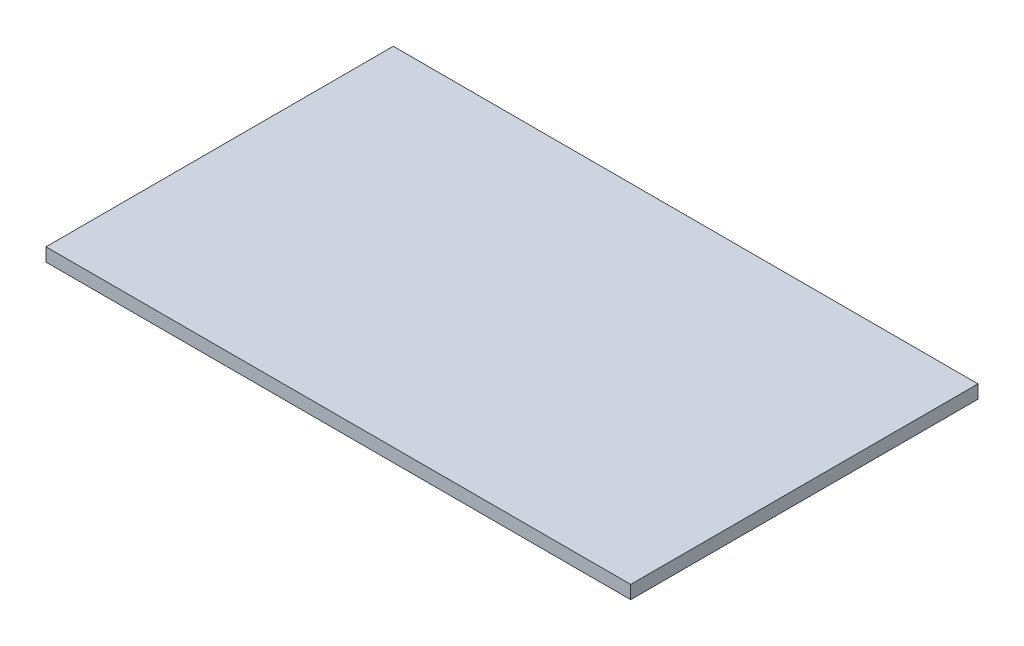
ISO-10303-21;
HEADER;
FILE_DESCRIPTION(('STEP AP214'),'2;1');
FILE_NAME('part.step','',(''),(''),'','','');
FILE_SCHEMA(('AUTOMOTIVE_DESIGN { 1 0 10303 214 1 1 1 1 }'));
ENDSEC;
DATA;
#1=APPLICATION_CONTEXT('core data for automotive mechanical design processes');
#2=APPLICATION_PROTOCOL_DEFINITION('international standard','automotive_design',2000,#1);
#3=PRODUCT_CONTEXT('',#1,'mechanical');
#4=PRODUCT('Part','Part','',(#3));
#5=PRODUCT_RELATED_PRODUCT_CATEGORY('part','',(#4));
#6=PRODUCT_DEFINITION_FORMATION('','',#4);
#7=PRODUCT_DEFINITION_CONTEXT('part definition',#1,'design');
#8=PRODUCT_DEFINITION('design','',#6,#7);
#9=PRODUCT_DEFINITION_SHAPE('','',#8);
#10=(LENGTH_UNIT() NAMED_UNIT(*) SI_UNIT(.MILLI.,.METRE.));
#11=(NAMED_UNIT(*) PLANE_ANGLE_UNIT() SI_UNIT($,.RADIAN.));
#12=(NAMED_UNIT(*) SI_UNIT($,.STERADIAN.) SOLID_ANGLE_UNIT());
#13=UNCERTAINTY_MEASURE_WITH_UNIT(LENGTH_MEASURE(1.E-05),#10,'distance_accuracy_value','');
#14=(GEOMETRIC_REPRESENTATION_CONTEXT(3) GLOBAL_UNCERTAINTY_ASSIGNED_CONTEXT((#13)) GLOBAL_UNIT_ASSIGNED_CONTEXT((#10,
#11,#12)) REPRESENTATION_CONTEXT('',''));
#15=CARTESIAN_POINT('',(0.,0.,0.));
#16=DIRECTION('',(0.,0.,1.));
#17=DIRECTION('',(1.,0.,0.));
#18=AXIS2_PLACEMENT_3D('',#15,#16,#17);
#19=CARTESIAN_POINT('',(0.,38.1,4.44089209850063E-13));
#20=DIRECTION('',(1.00000000000001,0.,0.));
#21=DIRECTION('',(0.,0.,-0.999999999999996));
#22=AXIS2_PLACEMENT_3D('',#19,#20,#21);
#23=PLANE('',#22);
#24=DIRECTION('',(0.,0.,0.999999999999996));
#25=VECTOR('',#24,1.);
#26=CARTESIAN_POINT('',(0.,0.,0.));
#27=LINE('',#26,#25);
#28=CARTESIAN_POINT('',(0.,5.32907051820075E-12,-995.679999999995));
#29=VERTEX_POINT('',#28);
#30=CARTESIAN_POINT('',(0.,0.,0.));
#31=VERTEX_POINT('',#30);
#32=EDGE_CURVE('E95',#29,#31,#27,.T.);
#33=ORIENTED_EDGE('',*,*,#32,.T.);
#34=DIRECTION('',(0.,-1.,0.));
#35=VECTOR('',#34,1.);
#36=CARTESIAN_POINT('',(0.,38.1,4.44089209850063E-13));
#37=LINE('',#36,#35);
#38=CARTESIAN_POINT('',(0.,38.1,4.44089209850063E-13));
#39=VERTEX_POINT('',#38);
#40=EDGE_CURVE('E11',#39,#31,#37,.T.);
#41=ORIENTED_EDGE('',*,*,#40,.F.);
#42=DIRECTION('',(0.,0.,0.999999999999996));
#43=VECTOR('',#42,1.);
#44=CARTESIAN_POINT('',(0.,38.1,4.44089209850063E-13));
#45=LINE('',#44,#43);
#46=CARTESIAN_POINT('',(0.,38.1000000000049,-995.679999999995));
#47=VERTEX_POINT('',#46);
#48=EDGE_CURVE('E83',#47,#39,#45,.T.);
#49=ORIENTED_EDGE('',*,*,#48,.F.);
#50=DIRECTION('',(0.,-1.,0.));
#51=VECTOR('',#50,1.);
#52=CARTESIAN_POINT('',(0.,38.1000000000049,-995.679999999995));
#53=LINE('',#52,#51);
#54=EDGE_CURVE('E91',#47,#29,#53,.T.);
#55=ORIENTED_EDGE('',*,*,#54,.T.);
#56=EDGE_LOOP('',(#33,#41,#49,#55));
#57=FACE_BOUND('',#56,.T.);
#58=ADVANCED_FACE('F32',(#57),#23,.F.);
#59=CARTESIAN_POINT('',(0.,38.1,4.44089209850063E-13));
#60=DIRECTION('',(0.,0.,-0.999999999999995));
#61=DIRECTION('',(-1.00000000000001,0.,0.));
#62=AXIS2_PLACEMENT_3D('',#59,#60,#61);
#63=PLANE('',#62);
#64=DIRECTION('',(1.00000000000001,0.,0.));
#65=VECTOR('',#64,1.);
#66=CARTESIAN_POINT('',(0.,0.,0.));
#67=LINE('',#66,#65);
#68=CARTESIAN_POINT('',(1676.40000000001,0.,0.));
#69=VERTEX_POINT('',#68);
#70=EDGE_CURVE('E87',#31,#69,#67,.T.);
#71=ORIENTED_EDGE('',*,*,#70,.T.);
#72=DIRECTION('',(0.,-1.,0.));
#73=VECTOR('',#72,1.);
#74=CARTESIAN_POINT('',(1676.40000000001,38.1,1.77635683940025E-12));
#75=LINE('',#74,#73);
#76=CARTESIAN_POINT('',(1676.40000000001,38.1,1.77635683940025E-12));
#77=VERTEX_POINT('',#76);
#78=EDGE_CURVE('E40',#77,#69,#75,.T.);
#79=ORIENTED_EDGE('',*,*,#78,.F.);
#80=DIRECTION('',(1.00000000000001,0.,0.));
#81=VECTOR('',#80,1.);
#82=CARTESIAN_POINT('',(0.,38.1,4.44089209850063E-13));
#83=LINE('',#82,#81);
#84=EDGE_CURVE('E78',#39,#77,#83,.T.);
#85=ORIENTED_EDGE('',*,*,#84,.F.);
#86=ORIENTED_EDGE('',*,*,#40,.T.);
#87=EDGE_LOOP('',(#71,#79,#85,#86));
#88=FACE_BOUND('',#87,.T.);
#89=ADVANCED_FACE('F86',(#88),#63,.F.);
#90=CARTESIAN_POINT('',(1676.40000000001,38.1,1.77635683940025E-12));
#91=DIRECTION('',(-1.00000000000001,0.,0.));
#92=DIRECTION('',(0.,0.,0.999999999999996));
#93=AXIS2_PLACEMENT_3D('',#90,#91,#92);
#94=PLANE('',#93);
#95=DIRECTION('',(0.,0.,-0.999999999999996));
#96=VECTOR('',#95,1.);
#97=CARTESIAN_POINT('',(1676.40000000001,0.,0.));
#98=LINE('',#97,#96);
#99=CARTESIAN_POINT('',(1676.40000000001,5.32907051820075E-12,-995.679999999995));
#100=VERTEX_POINT('',#99);
#101=EDGE_CURVE('E65',#69,#100,#98,.T.);
#102=ORIENTED_EDGE('',*,*,#101,.T.);
#103=DIRECTION('',(0.,-1.,0.));
#104=VECTOR('',#103,1.);
#105=CARTESIAN_POINT('',(1676.40000000001,38.1000000000054,-995.679999999995));
#106=LINE('',#105,#104);
#107=CARTESIAN_POINT('',(1676.40000000001,38.1000000000054,-995.679999999995));
#108=VERTEX_POINT('',#107);
#109=EDGE_CURVE('E88',#108,#100,#106,.T.);
#110=ORIENTED_EDGE('',*,*,#109,.F.);
#111=DIRECTION('',(0.,0.,-0.999999999999996));
#112=VECTOR('',#111,1.);
#113=CARTESIAN_POINT('',(1676.40000000001,38.1,1.77635683940025E-12));
#114=LINE('',#113,#112);
#115=EDGE_CURVE('E81',#77,#108,#114,.T.);
#116=ORIENTED_EDGE('',*,*,#115,.F.);
#117=ORIENTED_EDGE('',*,*,#78,.T.);
#118=EDGE_LOOP('',(#102,#110,#116,#117));
#119=FACE_BOUND('',#118,.T.);
#120=ADVANCED_FACE('F89',(#119),#94,.F.);
#121=CARTESIAN_POINT('',(0.,38.1000000000049,-995.679999999995));
#122=DIRECTION('',(0.,0.,0.999999999999995));
#123=DIRECTION('',(1.00000000000001,0.,0.));
#124=AXIS2_PLACEMENT_3D('',#121,#122,#123);
#125=PLANE('',#124);
#126=DIRECTION('',(-1.00000000000001,0.,0.));
#127=VECTOR('',#126,1.);
#128=CARTESIAN_POINT('',(0.,5.32907051820075E-12,-995.679999999995));
#129=LINE('',#128,#127);
#130=EDGE_CURVE('E71',#100,#29,#129,.T.);
#131=ORIENTED_EDGE('',*,*,#130,.T.);
#132=ORIENTED_EDGE('',*,*,#54,.F.);
#133=DIRECTION('',(-1.00000000000001,0.,0.));
#134=VECTOR('',#133,1.);
#135=CARTESIAN_POINT('',(0.,38.1000000000049,-995.679999999995));
#136=LINE('',#135,#134);
#137=EDGE_CURVE('E48',#108,#47,#136,.T.);
#138=ORIENTED_EDGE('',*,*,#137,.F.);
#139=ORIENTED_EDGE('',*,*,#109,.T.);
#140=EDGE_LOOP('',(#131,#132,#138,#139));
#141=FACE_BOUND('',#140,.T.);
#142=ADVANCED_FACE('F102',(#141),#125,.F.);
#143=CARTESIAN_POINT('',(0.,38.1,4.44089209850063E-13));
#144=DIRECTION('',(0.,-1.,0.));
#145=DIRECTION('',(0.,0.,-0.999999999999996));
#146=AXIS2_PLACEMENT_3D('',#143,#144,#145);
#147=PLANE('',#146);
#148=ORIENTED_EDGE('',*,*,#48,.T.);
#149=ORIENTED_EDGE('',*,*,#84,.T.);
#150=ORIENTED_EDGE('',*,*,#115,.T.);
#151=ORIENTED_EDGE('',*,*,#137,.T.);
#152=EDGE_LOOP('',(#148,#149,#150,#151));
#153=FACE_BOUND('',#152,.T.);
#154=ADVANCED_FACE('F79',(#153),#147,.F.);
#155=CARTESIAN_POINT('',(0.,0.,0.));
#156=DIRECTION('',(0.,-1.,0.));
#157=DIRECTION('',(0.,0.,-0.999999999999996));
#158=AXIS2_PLACEMENT_3D('',#155,#156,#157);
#159=PLANE('',#158);
#160=ORIENTED_EDGE('',*,*,#32,.F.);
#161=ORIENTED_EDGE('',*,*,#130,.F.);
#162=ORIENTED_EDGE('',*,*,#101,.F.);
#163=ORIENTED_EDGE('',*,*,#70,.F.);
#164=EDGE_LOOP('',(#160,#161,#162,#163));
#165=FACE_BOUND('',#164,.T.);
#166=ADVANCED_FACE('F105',(#165),#159,.T.);
#167=CLOSED_SHELL('',(#58,#89,#120,#142,#154,#166));
#168=MANIFOLD_SOLID_BREP('B2',#167);
#169=ADVANCED_BREP_SHAPE_REPRESENTATION('',(#18,#168),#14);
#170=SHAPE_DEFINITION_REPRESENTATION(#9,#169);
ENDSEC;
END-ISO-10303-21;
